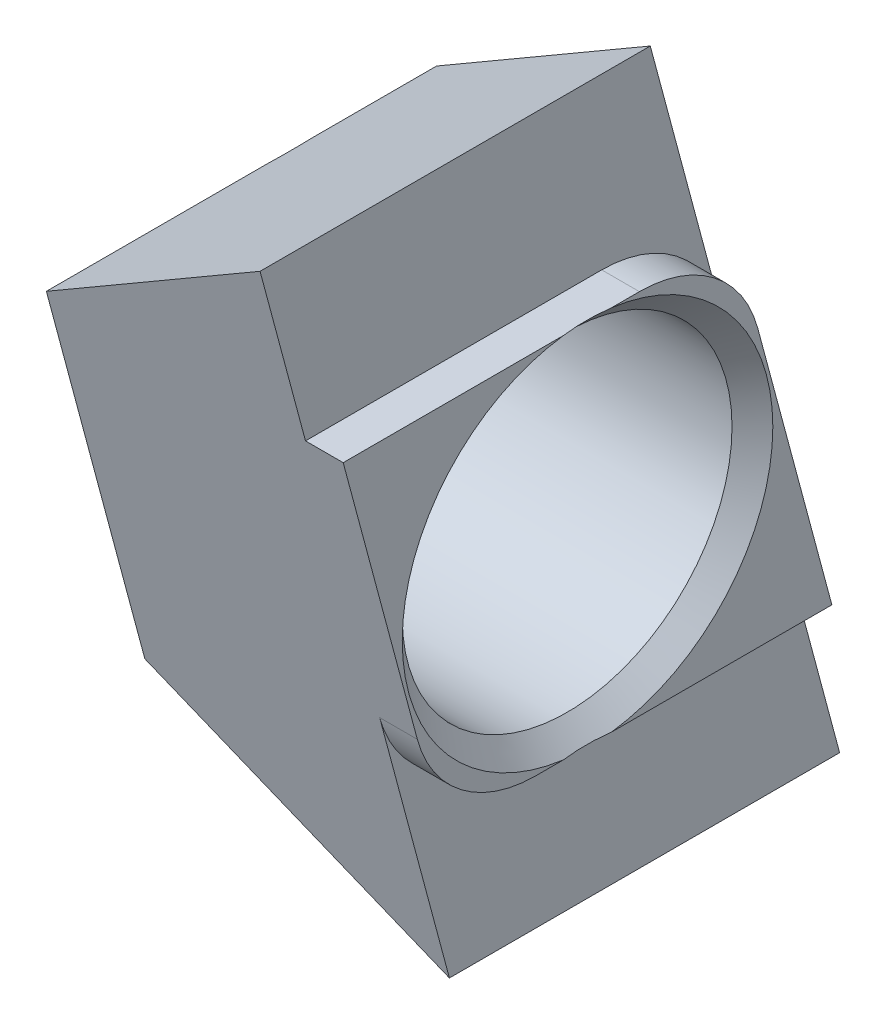
ISO-10303-21;
HEADER;
FILE_DESCRIPTION(('STEP AP214'),'2;1');
FILE_NAME('part.step','',(''),(''),'','','');
FILE_SCHEMA(('AUTOMOTIVE_DESIGN { 1 0 10303 214 1 1 1 1 }'));
ENDSEC;
DATA;
#1=APPLICATION_CONTEXT('core data for automotive mechanical design processes');
#2=APPLICATION_PROTOCOL_DEFINITION('international standard','automotive_design',2000,#1);
#3=PRODUCT_CONTEXT('',#1,'mechanical');
#4=PRODUCT('Part','Part','',(#3));
#5=PRODUCT_RELATED_PRODUCT_CATEGORY('part','',(#4));
#6=PRODUCT_DEFINITION_FORMATION('','',#4);
#7=PRODUCT_DEFINITION_CONTEXT('part definition',#1,'design');
#8=PRODUCT_DEFINITION('design','',#6,#7);
#9=PRODUCT_DEFINITION_SHAPE('','',#8);
#10=(LENGTH_UNIT() NAMED_UNIT(*) SI_UNIT(.MILLI.,.METRE.));
#11=(NAMED_UNIT(*) PLANE_ANGLE_UNIT() SI_UNIT($,.RADIAN.));
#12=(NAMED_UNIT(*) SI_UNIT($,.STERADIAN.) SOLID_ANGLE_UNIT());
#13=UNCERTAINTY_MEASURE_WITH_UNIT(LENGTH_MEASURE(1.E-05),#10,'distance_accuracy_value','');
#14=(GEOMETRIC_REPRESENTATION_CONTEXT(3) GLOBAL_UNCERTAINTY_ASSIGNED_CONTEXT((#13)) GLOBAL_UNIT_ASSIGNED_CONTEXT((#10,
#11,#12)) REPRESENTATION_CONTEXT('',''));
#15=CARTESIAN_POINT('',(0.,0.,0.));
#16=DIRECTION('',(0.,0.,1.));
#17=DIRECTION('',(1.,0.,0.));
#18=AXIS2_PLACEMENT_3D('',#15,#16,#17);
#19=CARTESIAN_POINT('',(-6.3,0.,4.14110472164033));
#20=DIRECTION('',(-1.,0.,0.));
#21=DIRECTION('',(0.,0.,1.));
#22=AXIS2_PLACEMENT_3D('',#19,#20,#21);
#23=PLANE('',#22);
#24=DIRECTION('',(0.,0.,1.));
#25=VECTOR('',#24,1.);
#26=CARTESIAN_POINT('',(-6.3,3.90000000000003,-2.13148577840691));
#27=LINE('',#26,#25);
#28=CARTESIAN_POINT('',(-6.3,3.90000000000003,5.18610657212172));
#29=VERTEX_POINT('',#28);
#30=CARTESIAN_POINT('',(-6.3,3.90000000000003,0.508418135000282));
#31=VERTEX_POINT('',#30);
#32=EDGE_CURVE('E166',#29,#31,#27,.F.);
#33=ORIENTED_EDGE('',*,*,#32,.T.);
#34=CARTESIAN_POINT('',(-6.3,0.,0.));
#35=DIRECTION('',(-1.,0.,0.));
#36=DIRECTION('',(0.,0.,1.));
#37=AXIS2_PLACEMENT_3D('',#34,#35,#36);
#38=CIRCLE('',#37,3.93299999999967);
#39=CARTESIAN_POINT('',(-6.3,-3.90000000000003,0.508418135000279));
#40=VERTEX_POINT('',#39);
#41=EDGE_CURVE('E236',#31,#40,#38,.F.);
#42=ORIENTED_EDGE('',*,*,#41,.T.);
#43=DIRECTION('',(0.,0.,-1.));
#44=VECTOR('',#43,1.);
#45=CARTESIAN_POINT('',(-6.3,-3.90000000000003,2.13148577840691));
#46=LINE('',#45,#44);
#47=CARTESIAN_POINT('',(-6.3,-3.90000000000003,3.09610287115894));
#48=VERTEX_POINT('',#47);
#49=EDGE_CURVE('E188',#40,#48,#46,.F.);
#50=ORIENTED_EDGE('',*,*,#49,.T.);
#51=CARTESIAN_POINT('',(-6.3,-7.5,2.13148577840691));
#52=CARTESIAN_POINT('',(-6.3,-2.5,3.47123174056252));
#53=CARTESIAN_POINT('',(-6.3,2.5,4.81097770271814));
#54=CARTESIAN_POINT('',(-6.3,7.5,6.15072366487375));
#55=B_SPLINE_CURVE_WITH_KNOTS('',3,(#51,#52,#53,#54),.UNSPECIFIED.,.F.,.F.,(4,4),(0.,1.),.UNSPECIFIED.);
#56=EDGE_CURVE('E331',#48,#29,#55,.T.);
#57=ORIENTED_EDGE('',*,*,#56,.T.);
#58=EDGE_LOOP('',(#33,#42,#50,#57));
#59=FACE_BOUND('',#58,.T.);
#60=ADVANCED_FACE('F35',(#59),#23,.T.);
#61=CARTESIAN_POINT('',(0.,1.29999999999999,-1.10105270241365));
#62=DIRECTION('',(1.,0.,0.));
#63=DIRECTION('',(0.,0.,-1.));
#64=AXIS2_PLACEMENT_3D('',#61,#62,#63);
#65=PLANE('',#64);
#66=DIRECTION('',(0.,0.,1.));
#67=VECTOR('',#66,1.);
#68=CARTESIAN_POINT('',(0.,3.9,-1.10105270241365));
#69=LINE('',#68,#67);
#70=CARTESIAN_POINT('',(0.,3.9,-1.10105270241365));
#71=VERTEX_POINT('',#70);
#72=CARTESIAN_POINT('',(0.,3.9,-0.508418135000436));
#73=VERTEX_POINT('',#72);
#74=EDGE_CURVE('E246',#71,#73,#69,.T.);
#75=ORIENTED_EDGE('',*,*,#74,.T.);
#76=CARTESIAN_POINT('',(0.,0.,0.));
#77=DIRECTION('',(1.,0.,0.));
#78=DIRECTION('',(0.,0.,-1.));
#79=AXIS2_PLACEMENT_3D('',#76,#77,#78);
#80=CIRCLE('',#79,3.93299999999966);
#81=CARTESIAN_POINT('',(0.,-3.9,-0.508418135000436));
#82=VERTEX_POINT('',#81);
#83=EDGE_CURVE('E200',#73,#82,#80,.F.);
#84=ORIENTED_EDGE('',*,*,#83,.T.);
#85=DIRECTION('',(0.,0.,-1.));
#86=VECTOR('',#85,1.);
#87=CARTESIAN_POINT('',(0.,-3.9,1.10105270241365));
#88=LINE('',#87,#86);
#89=CARTESIAN_POINT('',(0.,-3.9,-5.18610657212171));
#90=VERTEX_POINT('',#89);
#91=EDGE_CURVE('E264',#82,#90,#88,.T.);
#92=ORIENTED_EDGE('',*,*,#91,.T.);
#93=DIRECTION('',(0.,0.965925826289068,0.25881904510252));
#94=VECTOR('',#93,1.);
#95=CARTESIAN_POINT('',(0.,-3.9,-5.18610657212171));
#96=LINE('',#95,#94);
#97=CARTESIAN_POINT('',(0.,1.97292951726655,-3.61245985076524));
#98=VERTEX_POINT('',#97);
#99=EDGE_CURVE('E270',#90,#98,#96,.T.);
#100=ORIENTED_EDGE('',*,*,#99,.T.);
#101=CARTESIAN_POINT('',(0.,1.29999999999999,-1.10105270241365));
#102=DIRECTION('',(1.,0.,0.));
#103=DIRECTION('',(0.,0.,-1.));
#104=AXIS2_PLACEMENT_3D('',#101,#102,#103);
#105=CIRCLE('',#104,2.60000000000001);
#106=EDGE_CURVE('E168',#98,#71,#105,.T.);
#107=ORIENTED_EDGE('',*,*,#106,.T.);
#108=EDGE_LOOP('',(#75,#84,#92,#100,#107));
#109=FACE_BOUND('',#108,.T.);
#110=ADVANCED_FACE('F250',(#109),#65,.T.);
#111=CARTESIAN_POINT('',(-0.800000000000001,1.29999999999999,-1.10105270241365));
#112=DIRECTION('',(1.,0.,0.));
#113=DIRECTION('',(0.,0.,-1.));
#114=AXIS2_PLACEMENT_3D('',#111,#112,#113);
#115=CYLINDRICAL_SURFACE('',#114,2.60000000000001);
#116=ORIENTED_EDGE('',*,*,#106,.F.);
#117=DIRECTION('',(1.,0.,0.));
#118=VECTOR('',#117,1.);
#119=CARTESIAN_POINT('',(-0.800000000000001,1.97292951726655,-3.61245985076524));
#120=LINE('',#119,#118);
#121=CARTESIAN_POINT('',(-0.800000000000001,1.97292951726655,-3.61245985076523));
#122=VERTEX_POINT('',#121);
#123=EDGE_CURVE('E195',#122,#98,#120,.T.);
#124=ORIENTED_EDGE('',*,*,#123,.F.);
#125=CARTESIAN_POINT('',(-0.800000000000001,1.29999999999999,-1.10105270241365));
#126=DIRECTION('',(1.,0.,0.));
#127=DIRECTION('',(0.,0.,-1.));
#128=AXIS2_PLACEMENT_3D('',#125,#126,#127);
#129=CIRCLE('',#128,2.60000000000001);
#130=CARTESIAN_POINT('',(-0.800000000000001,3.9,-1.10105270241365));
#131=VERTEX_POINT('',#130);
#132=EDGE_CURVE('E272',#122,#131,#129,.T.);
#133=ORIENTED_EDGE('',*,*,#132,.T.);
#134=DIRECTION('',(1.,0.,0.));
#135=VECTOR('',#134,1.);
#136=CARTESIAN_POINT('',(-0.800000000000001,3.9,-1.10105270241365));
#137=LINE('',#136,#135);
#138=EDGE_CURVE('E281',#131,#71,#137,.T.);
#139=ORIENTED_EDGE('',*,*,#138,.T.);
#140=EDGE_LOOP('',(#116,#124,#133,#139));
#141=FACE_BOUND('',#140,.T.);
#142=ADVANCED_FACE('F320',(#141),#115,.T.);
#143=CARTESIAN_POINT('',(-0.800000000000001,-3.9,-5.18610657212171));
#144=DIRECTION('',(0.,0.25881904510252,-0.965925826289068));
#145=DIRECTION('',(0.,0.965925826289068,0.25881904510252));
#146=AXIS2_PLACEMENT_3D('',#143,#144,#145);
#147=PLANE('',#146);
#148=ORIENTED_EDGE('',*,*,#99,.F.);
#149=DIRECTION('',(1.,0.,0.));
#150=VECTOR('',#149,1.);
#151=CARTESIAN_POINT('',(-0.800000000000001,-3.9,-5.18610657212171));
#152=LINE('',#151,#150);
#153=CARTESIAN_POINT('',(-0.800000000000001,-3.9,-5.18610657212171));
#154=VERTEX_POINT('',#153);
#155=EDGE_CURVE('E279',#154,#90,#152,.T.);
#156=ORIENTED_EDGE('',*,*,#155,.F.);
#157=CARTESIAN_POINT('',(-0.800000000000001,7.5,-2.13148577840691));
#158=CARTESIAN_POINT('',(-0.800000000000001,2.5,-3.47123174056252));
#159=CARTESIAN_POINT('',(-0.800000000000001,-2.5,-4.81097770271814));
#160=CARTESIAN_POINT('',(-0.800000000000001,-7.5,-6.15072366487375));
#161=B_SPLINE_CURVE_WITH_KNOTS('',3,(#157,#158,#159,#160),.UNSPECIFIED.,.F.,.F.,(4,4),(0.,1.),.UNSPECIFIED.);
#162=CARTESIAN_POINT('',(-0.800000000000001,-7.5,-6.15072366487375));
#163=VERTEX_POINT('',#162);
#164=EDGE_CURVE('E161',#154,#163,#161,.T.);
#165=ORIENTED_EDGE('',*,*,#164,.T.);
#166=DIRECTION('',(-0.827835666345006,0.541856072516727,0.145189897044757));
#167=VECTOR('',#166,1.);
#168=CARTESIAN_POINT('',(-2.53078460239917,-6.36712280570237,-5.84717013553806));
#169=LINE('',#168,#167);
#170=CARTESIAN_POINT('',(-6.3,-3.90000000000003,-5.18610657212172));
#171=VERTEX_POINT('',#170);
#172=EDGE_CURVE('E174',#171,#163,#169,.F.);
#173=ORIENTED_EDGE('',*,*,#172,.F.);
#174=CARTESIAN_POINT('',(-6.3,7.5,-2.13148577840691));
#175=CARTESIAN_POINT('',(-6.3,2.5,-3.47123174056252));
#176=CARTESIAN_POINT('',(-6.3,-2.5,-4.81097770271814));
#177=CARTESIAN_POINT('',(-6.3,-7.5,-6.15072366487375));
#178=B_SPLINE_CURVE_WITH_KNOTS('',3,(#174,#175,#176,#177),.UNSPECIFIED.,.F.,.F.,(4,4),(0.,1.),.UNSPECIFIED.);
#179=CARTESIAN_POINT('',(-6.3,3.90000000000003,-3.09610287115894));
#180=VERTEX_POINT('',#179);
#181=EDGE_CURVE('E180',#180,#171,#178,.T.);
#182=ORIENTED_EDGE('',*,*,#181,.F.);
#183=DIRECTION('',(-0.827835666345006,-0.541856072516727,-0.145189897044757));
#184=VECTOR('',#183,1.);
#185=CARTESIAN_POINT('',(-0.8,7.5,-2.13148577840691));
#186=LINE('',#185,#184);
#187=CARTESIAN_POINT('',(-0.800000000000001,7.5,-2.13148577840691));
#188=VERTEX_POINT('',#187);
#189=EDGE_CURVE('E169',#180,#188,#186,.F.);
#190=ORIENTED_EDGE('',*,*,#189,.T.);
#191=EDGE_CURVE('E157',#188,#122,#161,.T.);
#192=ORIENTED_EDGE('',*,*,#191,.T.);
#193=ORIENTED_EDGE('',*,*,#123,.T.);
#194=EDGE_LOOP('',(#148,#156,#165,#173,#182,#190,#192,#193));
#195=FACE_BOUND('',#194,.T.);
#196=ADVANCED_FACE('F317',(#195),#147,.T.);
#197=CARTESIAN_POINT('',(-0.800000000000001,-3.9,1.10105270241365));
#198=DIRECTION('',(0.,-1.,0.));
#199=DIRECTION('',(0.,0.,-1.));
#200=AXIS2_PLACEMENT_3D('',#197,#198,#199);
#201=PLANE('',#200);
#202=ORIENTED_EDGE('',*,*,#91,.F.);
#203=CARTESIAN_POINT('',(0.,-3.9,-0.508418135000436));
#204=CARTESIAN_POINT('',(-0.0219999999997728,-3.9,-0.338945423333624));
#205=CARTESIAN_POINT('',(-0.0329999999996592,-3.9,-0.169472711666812));
#206=CARTESIAN_POINT('',(-0.032999999999659,-3.9,0.169472711666811));
#207=CARTESIAN_POINT('',(-0.0219999999997725,-3.9,0.338945423333623));
#208=CARTESIAN_POINT('',(0.,-3.9,0.508418135000435));
#209=B_SPLINE_CURVE_WITH_KNOTS('',3,(#203,#204,#205,#206,#207,#208),.UNSPECIFIED.,.F.,.F.,(4,2,
4),(0.,0.509487978265728,1.01897595653146),.UNSPECIFIED.);
#210=CARTESIAN_POINT('',(0.,-3.9,0.508418135000435));
#211=VERTEX_POINT('',#210);
#212=EDGE_CURVE('E203',#82,#211,#209,.T.);
#213=ORIENTED_EDGE('',*,*,#212,.T.);
#214=CARTESIAN_POINT('',(0.,-3.9,1.10105270241365));
#215=VERTEX_POINT('',#214);
#216=EDGE_CURVE('E261',#215,#211,#88,.T.);
#217=ORIENTED_EDGE('',*,*,#216,.F.);
#218=DIRECTION('',(1.,0.,0.));
#219=VECTOR('',#218,1.);
#220=CARTESIAN_POINT('',(-0.800000000000001,-3.9,1.10105270241365));
#221=LINE('',#220,#219);
#222=CARTESIAN_POINT('',(-0.800000000000001,-3.9,1.10105270241365));
#223=VERTEX_POINT('',#222);
#224=EDGE_CURVE('E277',#223,#215,#221,.T.);
#225=ORIENTED_EDGE('',*,*,#224,.F.);
#226=DIRECTION('',(0.,0.,-1.));
#227=VECTOR('',#226,1.);
#228=CARTESIAN_POINT('',(-0.800000000000001,-3.9,1.10105270241365));
#229=LINE('',#228,#227);
#230=EDGE_CURVE('E283',#223,#154,#229,.T.);
#231=ORIENTED_EDGE('',*,*,#230,.T.);
#232=ORIENTED_EDGE('',*,*,#155,.T.);
#233=EDGE_LOOP('',(#202,#213,#217,#225,#231,#232));
#234=FACE_BOUND('',#233,.T.);
#235=ADVANCED_FACE('F215',(#234),#201,.T.);
#236=CARTESIAN_POINT('',(-0.800000000000001,-1.3,1.10105270241365));
#237=DIRECTION('',(1.,0.,0.));
#238=DIRECTION('',(0.,0.,-1.));
#239=AXIS2_PLACEMENT_3D('',#236,#237,#238);
#240=CYLINDRICAL_SURFACE('',#239,2.6);
#241=CARTESIAN_POINT('',(0.,-1.3,1.10105270241365));
#242=DIRECTION('',(1.,0.,0.));
#243=DIRECTION('',(0.,0.,-1.));
#244=AXIS2_PLACEMENT_3D('',#241,#242,#243);
#245=CIRCLE('',#244,2.6);
#246=CARTESIAN_POINT('',(0.,-1.97292951726655,3.61245985076523));
#247=VERTEX_POINT('',#246);
#248=EDGE_CURVE('E269',#247,#215,#245,.T.);
#249=ORIENTED_EDGE('',*,*,#248,.F.);
#250=DIRECTION('',(1.,0.,0.));
#251=VECTOR('',#250,1.);
#252=CARTESIAN_POINT('',(-0.800000000000001,-1.97292951726655,3.61245985076523));
#253=LINE('',#252,#251);
#254=CARTESIAN_POINT('',(-0.800000000000001,-1.97292951726656,3.61245985076523));
#255=VERTEX_POINT('',#254);
#256=EDGE_CURVE('E280',#255,#247,#253,.T.);
#257=ORIENTED_EDGE('',*,*,#256,.F.);
#258=CARTESIAN_POINT('',(-0.800000000000001,-1.3,1.10105270241365));
#259=DIRECTION('',(1.,0.,0.));
#260=DIRECTION('',(0.,0.,-1.));
#261=AXIS2_PLACEMENT_3D('',#258,#259,#260);
#262=CIRCLE('',#261,2.6);
#263=EDGE_CURVE('E290',#255,#223,#262,.T.);
#264=ORIENTED_EDGE('',*,*,#263,.T.);
#265=ORIENTED_EDGE('',*,*,#224,.T.);
#266=EDGE_LOOP('',(#249,#257,#264,#265));
#267=FACE_BOUND('',#266,.T.);
#268=ADVANCED_FACE('F311',(#267),#240,.T.);
#269=CARTESIAN_POINT('',(-0.800000000000001,3.9,5.18610657212171));
#270=DIRECTION('',(0.,-0.258819045102521,0.965925826289068));
#271=DIRECTION('',(0.,-0.965925826289068,-0.258819045102521));
#272=AXIS2_PLACEMENT_3D('',#269,#270,#271);
#273=PLANE('',#272);
#274=DIRECTION('',(0.,-0.965925826289068,-0.258819045102521));
#275=VECTOR('',#274,1.);
#276=CARTESIAN_POINT('',(0.,3.9,5.18610657212171));
#277=LINE('',#276,#275);
#278=CARTESIAN_POINT('',(0.,3.9,5.18610657212171));
#279=VERTEX_POINT('',#278);
#280=EDGE_CURVE('E254',#279,#247,#277,.T.);
#281=ORIENTED_EDGE('',*,*,#280,.F.);
#282=DIRECTION('',(1.,0.,0.));
#283=VECTOR('',#282,1.);
#284=CARTESIAN_POINT('',(-0.800000000000001,3.9,5.18610657212171));
#285=LINE('',#284,#283);
#286=CARTESIAN_POINT('',(-0.800000000000001,3.9,5.18610657212171));
#287=VERTEX_POINT('',#286);
#288=EDGE_CURVE('E148',#287,#279,#285,.T.);
#289=ORIENTED_EDGE('',*,*,#288,.F.);
#290=CARTESIAN_POINT('',(-0.800000000000001,-7.5,2.13148577840691));
#291=CARTESIAN_POINT('',(-0.800000000000001,-2.5,3.47123174056252));
#292=CARTESIAN_POINT('',(-0.800000000000001,2.5,4.81097770271814));
#293=CARTESIAN_POINT('',(-0.800000000000001,7.5,6.15072366487375));
#294=B_SPLINE_CURVE_WITH_KNOTS('',3,(#290,#291,#292,#293),.UNSPECIFIED.,.F.,.F.,(4,4),(0.,1.),.UNSPECIFIED.);
#295=CARTESIAN_POINT('',(-0.800000000000001,7.5,6.15072366487375));
#296=VERTEX_POINT('',#295);
#297=EDGE_CURVE('E140',#287,#296,#294,.T.);
#298=ORIENTED_EDGE('',*,*,#297,.T.);
#299=DIRECTION('',(-0.827835666345006,-0.541856072516727,-0.145189897044757));
#300=VECTOR('',#299,1.);
#301=CARTESIAN_POINT('',(-2.53078460239917,6.36712280570237,5.84717013553807));
#302=LINE('',#301,#300);
#303=EDGE_CURVE('E146',#29,#296,#302,.F.);
#304=ORIENTED_EDGE('',*,*,#303,.F.);
#305=ORIENTED_EDGE('',*,*,#56,.F.);
#306=DIRECTION('',(-0.827835666345006,0.541856072516727,0.145189897044757));
#307=VECTOR('',#306,1.);
#308=CARTESIAN_POINT('',(-0.800000000000001,-7.5,2.1314857784069));
#309=LINE('',#308,#307);
#310=CARTESIAN_POINT('',(-0.800000000000001,-7.5,2.13148577840691));
#311=VERTEX_POINT('',#310);
#312=EDGE_CURVE('E185',#48,#311,#309,.F.);
#313=ORIENTED_EDGE('',*,*,#312,.T.);
#314=EDGE_CURVE('E151',#311,#255,#294,.T.);
#315=ORIENTED_EDGE('',*,*,#314,.T.);
#316=ORIENTED_EDGE('',*,*,#256,.T.);
#317=EDGE_LOOP('',(#281,#289,#298,#304,#305,#313,#315,#316));
#318=FACE_BOUND('',#317,.T.);
#319=ADVANCED_FACE('F143',(#318),#273,.T.);
#320=CARTESIAN_POINT('',(-0.800000000000001,3.9,-1.10105270241365));
#321=DIRECTION('',(0.,1.,0.));
#322=DIRECTION('',(0.,0.,1.));
#323=AXIS2_PLACEMENT_3D('',#320,#321,#322);
#324=PLANE('',#323);
#325=CARTESIAN_POINT('',(0.,3.9,0.508418135000435));
#326=VERTEX_POINT('',#325);
#327=EDGE_CURVE('E172',#326,#279,#69,.T.);
#328=ORIENTED_EDGE('',*,*,#327,.F.);
#329=CARTESIAN_POINT('',(0.,3.9,0.508418135000435));
#330=CARTESIAN_POINT('',(-0.0219999999997729,3.9,0.338945423333623));
#331=CARTESIAN_POINT('',(-0.0329999999996592,3.9,0.169472711666811));
#332=CARTESIAN_POINT('',(-0.0329999999996591,3.9,-0.169472711666812));
#333=CARTESIAN_POINT('',(-0.0219999999997725,3.9,-0.338945423333624));
#334=CARTESIAN_POINT('',(0.,3.9,-0.508418135000436));
#335=B_SPLINE_CURVE_WITH_KNOTS('',3,(#329,#330,#331,#332,#333,#334),.UNSPECIFIED.,.F.,.F.,(4,2,
4),(0.,0.509487978265728,1.01897595653146),.UNSPECIFIED.);
#336=EDGE_CURVE('E209',#326,#73,#335,.T.);
#337=ORIENTED_EDGE('',*,*,#336,.T.);
#338=ORIENTED_EDGE('',*,*,#74,.F.);
#339=ORIENTED_EDGE('',*,*,#138,.F.);
#340=DIRECTION('',(0.,0.,1.));
#341=VECTOR('',#340,1.);
#342=CARTESIAN_POINT('',(-0.800000000000001,3.9,-1.10105270241365));
#343=LINE('',#342,#341);
#344=EDGE_CURVE('E287',#131,#287,#343,.T.);
#345=ORIENTED_EDGE('',*,*,#344,.T.);
#346=ORIENTED_EDGE('',*,*,#288,.T.);
#347=EDGE_LOOP('',(#328,#337,#338,#339,#345,#346));
#348=FACE_BOUND('',#347,.T.);
#349=ADVANCED_FACE('F244',(#348),#324,.T.);
#350=ORIENTED_EDGE('',*,*,#216,.T.);
#351=CARTESIAN_POINT('',(0.,0.,0.));
#352=DIRECTION('',(1.,0.,0.));
#353=DIRECTION('',(0.,0.,-1.));
#354=AXIS2_PLACEMENT_3D('',#351,#352,#353);
#355=CIRCLE('',#354,3.93299999999966);
#356=EDGE_CURVE('E198',#211,#326,#355,.F.);
#357=ORIENTED_EDGE('',*,*,#356,.T.);
#358=ORIENTED_EDGE('',*,*,#327,.T.);
#359=ORIENTED_EDGE('',*,*,#280,.T.);
#360=ORIENTED_EDGE('',*,*,#248,.T.);
#361=EDGE_LOOP('',(#350,#357,#358,#359,#360));
#362=FACE_BOUND('',#361,.T.);
#363=ADVANCED_FACE('F266',(#362),#65,.T.);
#364=CARTESIAN_POINT('',(-0.800000000000001,0.,4.14110472164033));
#365=DIRECTION('',(-1.,0.,0.));
#366=DIRECTION('',(0.,0.,1.));
#367=AXIS2_PLACEMENT_3D('',#364,#365,#366);
#368=PLANE('',#367);
#369=ORIENTED_EDGE('',*,*,#230,.F.);
#370=ORIENTED_EDGE('',*,*,#263,.F.);
#371=ORIENTED_EDGE('',*,*,#314,.F.);
#372=DIRECTION('',(0.,0.,1.));
#373=VECTOR('',#372,1.);
#374=CARTESIAN_POINT('',(-0.800000000000001,-7.5,2.13148577840691));
#375=LINE('',#374,#373);
#376=EDGE_CURVE('E319',#163,#311,#375,.T.);
#377=ORIENTED_EDGE('',*,*,#376,.F.);
#378=ORIENTED_EDGE('',*,*,#164,.F.);
#379=EDGE_LOOP('',(#369,#370,#371,#377,#378));
#380=FACE_BOUND('',#379,.T.);
#381=ADVANCED_FACE('F330',(#380),#368,.F.);
#382=CARTESIAN_POINT('',(-0.800000000000001,7.5,-2.13148577840691));
#383=DIRECTION('',(-0.547659174694385,0.836701516894206,0.));
#384=DIRECTION('',(-0.836701516894206,-0.547659174694385,0.));
#385=AXIS2_PLACEMENT_3D('',#382,#383,#384);
#386=PLANE('',#385);
#387=CARTESIAN_POINT('',(-6.3,3.90000000000003,-0.508418135000284));
#388=VERTEX_POINT('',#387);
#389=EDGE_CURVE('E181',#388,#180,#27,.F.);
#390=ORIENTED_EDGE('',*,*,#389,.F.);
#391=CARTESIAN_POINT('',(-6.3,3.90000000000003,-0.508418135000289));
#392=CARTESIAN_POINT('',(-6.28670329670344,3.90870329670323,-0.338945423333526));
#393=CARTESIAN_POINT('',(-6.28005494505516,3.91305494505483,-0.169472711666764));
#394=CARTESIAN_POINT('',(-6.28005494505516,3.91305494505483,0.169472711666762));
#395=CARTESIAN_POINT('',(-6.28670329670344,3.90870329670323,0.338945423333525));
#396=CARTESIAN_POINT('',(-6.3,3.90000000000003,0.508418135000288));
#397=B_SPLINE_CURVE_WITH_KNOTS('',3,(#391,#392,#393,#394,#395,#396),.UNSPECIFIED.,.F.,.F.,(4,2,
4),(0.,0.508976656443405,1.01795331288681),.UNSPECIFIED.);
#398=EDGE_CURVE('E11',#388,#31,#397,.T.);
#399=ORIENTED_EDGE('',*,*,#398,.T.);
#400=ORIENTED_EDGE('',*,*,#32,.F.);
#401=ORIENTED_EDGE('',*,*,#303,.T.);
#402=DIRECTION('',(0.,0.,-1.));
#403=VECTOR('',#402,1.);
#404=CARTESIAN_POINT('',(-0.800000000000001,7.5,-2.13148577840691));
#405=LINE('',#404,#403);
#406=EDGE_CURVE('E154',#296,#188,#405,.T.);
#407=ORIENTED_EDGE('',*,*,#406,.T.);
#408=ORIENTED_EDGE('',*,*,#189,.F.);
#409=EDGE_LOOP('',(#390,#399,#400,#401,#407,#408));
#410=FACE_BOUND('',#409,.T.);
#411=ADVANCED_FACE('F164',(#410),#386,.T.);
#412=CARTESIAN_POINT('',(-0.800000000000001,-7.5,2.13148577840691));
#413=DIRECTION('',(-0.547659174694385,-0.836701516894206,0.));
#414=DIRECTION('',(0.836701516894206,-0.547659174694385,0.));
#415=AXIS2_PLACEMENT_3D('',#412,#413,#414);
#416=PLANE('',#415);
#417=ORIENTED_EDGE('',*,*,#49,.F.);
#418=CARTESIAN_POINT('',(-6.3,-3.90000000000003,0.508418135000285));
#419=CARTESIAN_POINT('',(-6.28670329670344,-3.90870329670323,0.338945423333523));
#420=CARTESIAN_POINT('',(-6.28005494505516,-3.91305494505483,0.169472711666762));
#421=CARTESIAN_POINT('',(-6.28005494505516,-3.91305494505483,-0.169472711666762));
#422=CARTESIAN_POINT('',(-6.28670329670344,-3.90870329670323,-0.338945423333524));
#423=CARTESIAN_POINT('',(-6.3,-3.90000000000003,-0.508418135000286));
#424=B_SPLINE_CURVE_WITH_KNOTS('',3,(#418,#419,#420,#421,#422,#423),.UNSPECIFIED.,.F.,.F.,(4,2,
4),(0.,0.508976656443402,1.0179533128868),.UNSPECIFIED.);
#425=CARTESIAN_POINT('',(-6.3,-3.90000000000003,-0.508418135000286));
#426=VERTEX_POINT('',#425);
#427=EDGE_CURVE('E48',#40,#426,#424,.T.);
#428=ORIENTED_EDGE('',*,*,#427,.T.);
#429=EDGE_CURVE('E186',#171,#426,#46,.F.);
#430=ORIENTED_EDGE('',*,*,#429,.F.);
#431=ORIENTED_EDGE('',*,*,#172,.T.);
#432=ORIENTED_EDGE('',*,*,#376,.T.);
#433=ORIENTED_EDGE('',*,*,#312,.F.);
#434=EDGE_LOOP('',(#417,#428,#430,#431,#432,#433));
#435=FACE_BOUND('',#434,.T.);
#436=ADVANCED_FACE('F225',(#435),#416,.T.);
#437=ORIENTED_EDGE('',*,*,#429,.T.);
#438=CARTESIAN_POINT('',(-6.3,0.,0.));
#439=DIRECTION('',(-1.,0.,0.));
#440=DIRECTION('',(0.,0.,1.));
#441=AXIS2_PLACEMENT_3D('',#438,#439,#440);
#442=CIRCLE('',#441,3.93299999999967);
#443=EDGE_CURVE('E237',#426,#388,#442,.F.);
#444=ORIENTED_EDGE('',*,*,#443,.T.);
#445=ORIENTED_EDGE('',*,*,#389,.T.);
#446=ORIENTED_EDGE('',*,*,#181,.T.);
#447=EDGE_LOOP('',(#437,#444,#445,#446));
#448=FACE_BOUND('',#447,.T.);
#449=ADVANCED_FACE('F229',(#448),#23,.T.);
#450=ORIENTED_EDGE('',*,*,#132,.F.);
#451=ORIENTED_EDGE('',*,*,#191,.F.);
#452=ORIENTED_EDGE('',*,*,#406,.F.);
#453=ORIENTED_EDGE('',*,*,#297,.F.);
#454=ORIENTED_EDGE('',*,*,#344,.F.);
#455=EDGE_LOOP('',(#450,#451,#452,#453,#454));
#456=FACE_BOUND('',#455,.T.);
#457=ADVANCED_FACE('F155',(#456),#368,.F.);
#458=CARTESIAN_POINT('',(-6.3,0.,0.));
#459=DIRECTION('',(-1.,0.,0.));
#460=DIRECTION('',(0.,0.,1.));
#461=AXIS2_PLACEMENT_3D('',#458,#459,#460);
#462=CYLINDRICAL_SURFACE('',#461,3.5);
#463=CARTESIAN_POINT('',(-0.432999999999658,0.,0.));
#464=DIRECTION('',(1.,0.,0.));
#465=DIRECTION('',(0.,0.,-1.));
#466=AXIS2_PLACEMENT_3D('',#463,#464,#465);
#467=CIRCLE('',#466,3.5);
#468=CARTESIAN_POINT('',(-0.432999999999659,0.,-3.5));
#469=VERTEX_POINT('',#468);
#470=EDGE_CURVE('E194',#469,#469,#467,.T.);
#471=ORIENTED_EDGE('',*,*,#470,.T.);
#472=EDGE_LOOP('',(#471));
#473=FACE_BOUND('',#472,.T.);
#474=CARTESIAN_POINT('',(-5.86700000000033,0.,0.));
#475=DIRECTION('',(-1.,0.,0.));
#476=DIRECTION('',(0.,0.,1.));
#477=AXIS2_PLACEMENT_3D('',#474,#475,#476);
#478=CIRCLE('',#477,3.5);
#479=CARTESIAN_POINT('',(-5.86700000000033,0.,3.5));
#480=VERTEX_POINT('',#479);
#481=EDGE_CURVE('E191',#480,#480,#478,.T.);
#482=ORIENTED_EDGE('',*,*,#481,.T.);
#483=EDGE_LOOP('',(#482));
#484=FACE_BOUND('',#483,.T.);
#485=ADVANCED_FACE('F223',(#473,#484),#462,.F.);
#486=CARTESIAN_POINT('',(-0.432999999999658,0.,0.));
#487=DIRECTION('',(1.,0.,0.));
#488=DIRECTION('',(0.,0.,-1.));
#489=AXIS2_PLACEMENT_3D('',#486,#487,#488);
#490=CONICAL_SURFACE('',#489,3.5,0.78539816339745);
#491=ORIENTED_EDGE('',*,*,#212,.F.);
#492=ORIENTED_EDGE('',*,*,#83,.F.);
#493=ORIENTED_EDGE('',*,*,#336,.F.);
#494=ORIENTED_EDGE('',*,*,#356,.F.);
#495=EDGE_LOOP('',(#491,#492,#493,#494));
#496=FACE_BOUND('',#495,.T.);
#497=ORIENTED_EDGE('',*,*,#470,.F.);
#498=EDGE_LOOP('',(#497));
#499=FACE_BOUND('',#498,.T.);
#500=ADVANCED_FACE('F219',(#496,#499),#490,.F.);
#501=CARTESIAN_POINT('',(-5.86700000000033,0.,0.));
#502=DIRECTION('',(-1.,0.,0.));
#503=DIRECTION('',(0.,0.,1.));
#504=AXIS2_PLACEMENT_3D('',#501,#502,#503);
#505=CONICAL_SURFACE('',#504,3.5,0.785398163397453);
#506=ORIENTED_EDGE('',*,*,#427,.F.);
#507=ORIENTED_EDGE('',*,*,#41,.F.);
#508=ORIENTED_EDGE('',*,*,#398,.F.);
#509=ORIENTED_EDGE('',*,*,#443,.F.);
#510=EDGE_LOOP('',(#506,#507,#508,#509));
#511=FACE_BOUND('',#510,.T.);
#512=ORIENTED_EDGE('',*,*,#481,.F.);
#513=EDGE_LOOP('',(#512));
#514=FACE_BOUND('',#513,.T.);
#515=ADVANCED_FACE('F37',(#511,#514),#505,.F.);
#516=CLOSED_SHELL('',(#60,#110,#142,#196,#235,#268,#319,#349,#363,#381,#411,#436,#449,#457,#485,
#500,#515));
#517=MANIFOLD_SOLID_BREP('B2',#516);
#518=ADVANCED_BREP_SHAPE_REPRESENTATION('',(#18,#517),#14);
#519=SHAPE_DEFINITION_REPRESENTATION(#9,#518);
ENDSEC;
END-ISO-10303-21;
